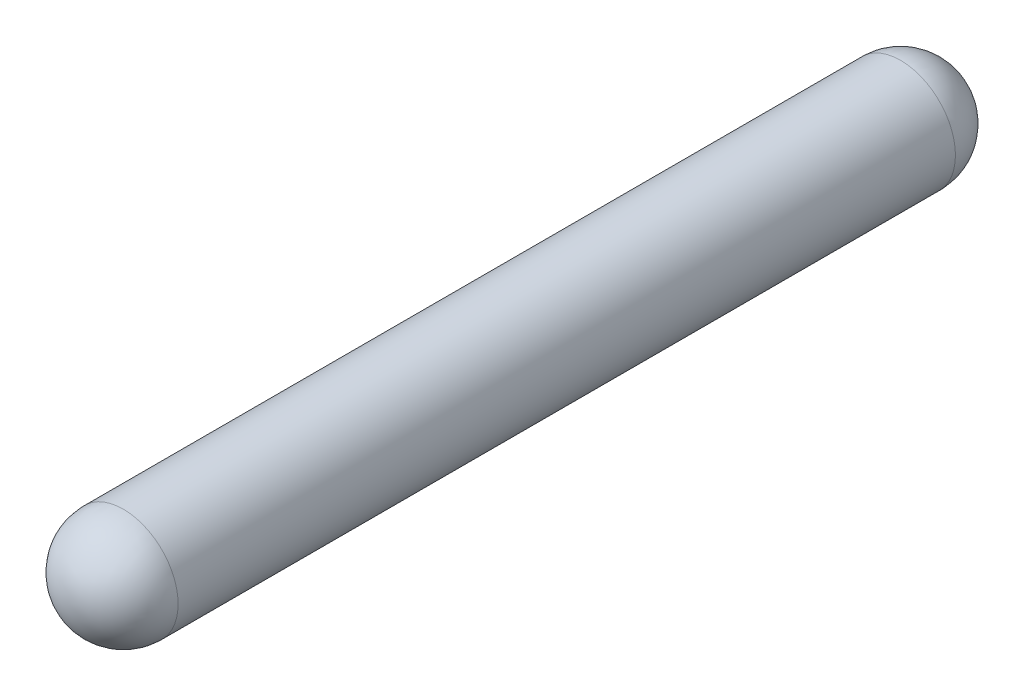
ISO-10303-21;
HEADER;
FILE_DESCRIPTION(('STEP AP214'),'2;1');
FILE_NAME('part.step','',(''),(''),'','','');
FILE_SCHEMA(('AUTOMOTIVE_DESIGN { 1 0 10303 214 1 1 1 1 }'));
ENDSEC;
DATA;
#1=APPLICATION_CONTEXT('core data for automotive mechanical design processes');
#2=APPLICATION_PROTOCOL_DEFINITION('international standard','automotive_design',2000,#1);
#3=PRODUCT_CONTEXT('',#1,'mechanical');
#4=PRODUCT('Part','Part','',(#3));
#5=PRODUCT_RELATED_PRODUCT_CATEGORY('part','',(#4));
#6=PRODUCT_DEFINITION_FORMATION('','',#4);
#7=PRODUCT_DEFINITION_CONTEXT('part definition',#1,'design');
#8=PRODUCT_DEFINITION('design','',#6,#7);
#9=PRODUCT_DEFINITION_SHAPE('','',#8);
#10=(LENGTH_UNIT() NAMED_UNIT(*) SI_UNIT(.MILLI.,.METRE.));
#11=(NAMED_UNIT(*) PLANE_ANGLE_UNIT() SI_UNIT($,.RADIAN.));
#12=(NAMED_UNIT(*) SI_UNIT($,.STERADIAN.) SOLID_ANGLE_UNIT());
#13=UNCERTAINTY_MEASURE_WITH_UNIT(LENGTH_MEASURE(1.E-05),#10,'distance_accuracy_value','');
#14=(GEOMETRIC_REPRESENTATION_CONTEXT(3) GLOBAL_UNCERTAINTY_ASSIGNED_CONTEXT((#13)) GLOBAL_UNIT_ASSIGNED_CONTEXT((#10,
#11,#12)) REPRESENTATION_CONTEXT('',''));
#15=CARTESIAN_POINT('',(0.,0.,0.));
#16=DIRECTION('',(0.,0.,1.));
#17=DIRECTION('',(1.,0.,0.));
#18=AXIS2_PLACEMENT_3D('',#15,#16,#17);
#19=CARTESIAN_POINT('',(5.08,2.54,-3.));
#20=DIRECTION('',(1.,0.,0.));
#21=DIRECTION('',(0.,-1.,0.));
#22=AXIS2_PLACEMENT_3D('',#19,#20,#21);
#23=SPHERICAL_SURFACE('',#22,0.458);
#24=CARTESIAN_POINT('',(5.08,2.54,-3.));
#25=DIRECTION('',(0.,0.,1.));
#26=DIRECTION('',(1.,0.,0.));
#27=AXIS2_PLACEMENT_3D('',#24,#25,#26);
#28=CIRCLE('',#27,0.458);
#29=CARTESIAN_POINT('',(5.538,2.54,-3.));
#30=VERTEX_POINT('',#29);
#31=CARTESIAN_POINT('',(4.622,2.54,-3.));
#32=VERTEX_POINT('',#31);
#33=EDGE_CURVE('E42',#30,#32,#28,.T.);
#34=ORIENTED_EDGE('',*,*,#33,.F.);
#35=CARTESIAN_POINT('',(5.08,2.54,-3.));
#36=DIRECTION('',(0.,0.,1.));
#37=DIRECTION('',(1.,0.,0.));
#38=AXIS2_PLACEMENT_3D('',#35,#36,#37);
#39=CIRCLE('',#38,0.458);
#40=EDGE_CURVE('E26',#32,#30,#39,.T.);
#41=ORIENTED_EDGE('',*,*,#40,.F.);
#42=EDGE_LOOP('',(#34,#41));
#43=FACE_BOUND('',#42,.T.);
#44=ADVANCED_FACE('F17',(#43),#23,.T.);
#45=CARTESIAN_POINT('',(5.08,2.54,3.5));
#46=DIRECTION('',(1.,0.,0.));
#47=DIRECTION('',(0.,1.,0.));
#48=AXIS2_PLACEMENT_3D('',#45,#46,#47);
#49=SPHERICAL_SURFACE('',#48,0.458);
#50=CARTESIAN_POINT('',(5.08,2.54,3.5));
#51=DIRECTION('',(0.,0.,1.));
#52=DIRECTION('',(1.,0.,0.));
#53=AXIS2_PLACEMENT_3D('',#50,#51,#52);
#54=CIRCLE('',#53,0.458);
#55=CARTESIAN_POINT('',(5.538,2.54,3.5));
#56=VERTEX_POINT('',#55);
#57=CARTESIAN_POINT('',(4.622,2.54,3.5));
#58=VERTEX_POINT('',#57);
#59=EDGE_CURVE('E11',#56,#58,#54,.F.);
#60=ORIENTED_EDGE('',*,*,#59,.F.);
#61=CARTESIAN_POINT('',(5.08,2.54,3.5));
#62=DIRECTION('',(0.,0.,1.));
#63=DIRECTION('',(1.,0.,0.));
#64=AXIS2_PLACEMENT_3D('',#61,#62,#63);
#65=CIRCLE('',#64,0.458);
#66=EDGE_CURVE('E34',#58,#56,#65,.F.);
#67=ORIENTED_EDGE('',*,*,#66,.F.);
#68=EDGE_LOOP('',(#60,#67));
#69=FACE_BOUND('',#68,.T.);
#70=ADVANCED_FACE('F49',(#69),#49,.T.);
#71=CARTESIAN_POINT('',(5.08,2.54,-3.));
#72=DIRECTION('',(0.,0.,1.));
#73=DIRECTION('',(1.,0.,0.));
#74=AXIS2_PLACEMENT_3D('',#71,#72,#73);
#75=CYLINDRICAL_SURFACE('',#74,0.458);
#76=ORIENTED_EDGE('',*,*,#66,.T.);
#77=ORIENTED_EDGE('',*,*,#59,.T.);
#78=EDGE_LOOP('',(#76,#77));
#79=FACE_BOUND('',#78,.T.);
#80=ORIENTED_EDGE('',*,*,#40,.T.);
#81=ORIENTED_EDGE('',*,*,#33,.T.);
#82=EDGE_LOOP('',(#80,#81));
#83=FACE_BOUND('',#82,.T.);
#84=ADVANCED_FACE('F45',(#79,#83),#75,.T.);
#85=CLOSED_SHELL('',(#44,#70,#84));
#86=MANIFOLD_SOLID_BREP('B1',#85);
#87=ADVANCED_BREP_SHAPE_REPRESENTATION('',(#18,#86),#14);
#88=SHAPE_DEFINITION_REPRESENTATION(#9,#87);
ENDSEC;
END-ISO-10303-21;
